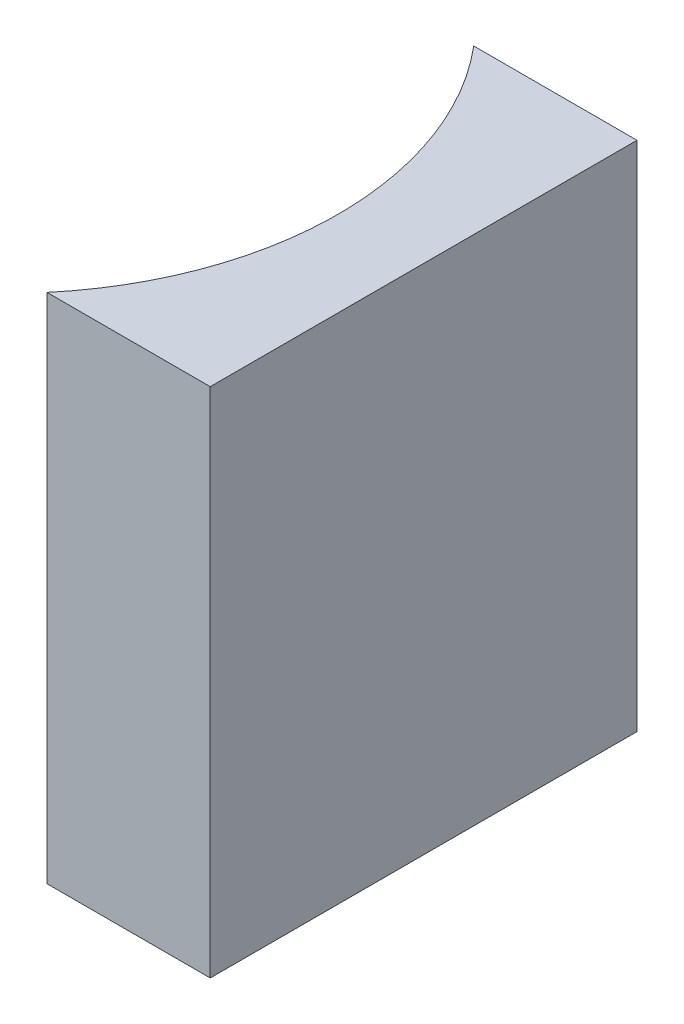
ISO-10303-21;
HEADER;
FILE_DESCRIPTION(('STEP AP214'),'2;1');
FILE_NAME('part.step','',(''),(''),'','','');
FILE_SCHEMA(('AUTOMOTIVE_DESIGN { 1 0 10303 214 1 1 1 1 }'));
ENDSEC;
DATA;
#1=APPLICATION_CONTEXT('core data for automotive mechanical design processes');
#2=APPLICATION_PROTOCOL_DEFINITION('international standard','automotive_design',2000,#1);
#3=PRODUCT_CONTEXT('',#1,'mechanical');
#4=PRODUCT('Part','Part','',(#3));
#5=PRODUCT_RELATED_PRODUCT_CATEGORY('part','',(#4));
#6=PRODUCT_DEFINITION_FORMATION('','',#4);
#7=PRODUCT_DEFINITION_CONTEXT('part definition',#1,'design');
#8=PRODUCT_DEFINITION('design','',#6,#7);
#9=PRODUCT_DEFINITION_SHAPE('','',#8);
#10=(LENGTH_UNIT() NAMED_UNIT(*) SI_UNIT(.MILLI.,.METRE.));
#11=(NAMED_UNIT(*) PLANE_ANGLE_UNIT() SI_UNIT($,.RADIAN.));
#12=(NAMED_UNIT(*) SI_UNIT($,.STERADIAN.) SOLID_ANGLE_UNIT());
#13=UNCERTAINTY_MEASURE_WITH_UNIT(LENGTH_MEASURE(1.E-05),#10,'distance_accuracy_value','');
#14=(GEOMETRIC_REPRESENTATION_CONTEXT(3) GLOBAL_UNCERTAINTY_ASSIGNED_CONTEXT((#13)) GLOBAL_UNIT_ASSIGNED_CONTEXT((#10,
#11,#12)) REPRESENTATION_CONTEXT('',''));
#15=CARTESIAN_POINT('',(0.,0.,0.));
#16=DIRECTION('',(0.,0.,1.));
#17=DIRECTION('',(1.,0.,0.));
#18=AXIS2_PLACEMENT_3D('',#15,#16,#17);
#19=CARTESIAN_POINT('',(0.,12.,0.));
#20=DIRECTION('',(0.,0.,1.));
#21=DIRECTION('',(1.,0.,0.));
#22=AXIS2_PLACEMENT_3D('',#19,#20,#21);
#23=PLANE('',#22);
#24=DIRECTION('',(-1.,0.,0.));
#25=VECTOR('',#24,1.);
#26=CARTESIAN_POINT('',(0.,0.,0.));
#27=LINE('',#26,#25);
#28=CARTESIAN_POINT('',(0.,0.,0.));
#29=VERTEX_POINT('',#28);
#30=CARTESIAN_POINT('',(-3.82555815598467,0.,0.));
#31=VERTEX_POINT('',#30);
#32=EDGE_CURVE('E98',#29,#31,#27,.T.);
#33=ORIENTED_EDGE('',*,*,#32,.T.);
#34=DIRECTION('',(0.,-1.,0.));
#35=VECTOR('',#34,1.);
#36=CARTESIAN_POINT('',(-3.82555815598467,12.,0.));
#37=LINE('',#36,#35);
#38=CARTESIAN_POINT('',(-3.82555815598467,12.,0.));
#39=VERTEX_POINT('',#38);
#40=EDGE_CURVE('E11',#39,#31,#37,.T.);
#41=ORIENTED_EDGE('',*,*,#40,.F.);
#42=DIRECTION('',(-1.,0.,0.));
#43=VECTOR('',#42,1.);
#44=CARTESIAN_POINT('',(0.,12.,0.));
#45=LINE('',#44,#43);
#46=CARTESIAN_POINT('',(0.,12.,0.));
#47=VERTEX_POINT('',#46);
#48=EDGE_CURVE('E86',#47,#39,#45,.T.);
#49=ORIENTED_EDGE('',*,*,#48,.F.);
#50=DIRECTION('',(0.,-1.,0.));
#51=VECTOR('',#50,1.);
#52=CARTESIAN_POINT('',(0.,12.,0.));
#53=LINE('',#52,#51);
#54=EDGE_CURVE('E94',#47,#29,#53,.T.);
#55=ORIENTED_EDGE('',*,*,#54,.T.);
#56=EDGE_LOOP('',(#33,#41,#49,#55));
#57=FACE_BOUND('',#56,.T.);
#58=ADVANCED_FACE('F35',(#57),#23,.F.);
#59=CARTESIAN_POINT('',(-9.76,12.,5.));
#60=DIRECTION('',(0.,-1.,0.));
#61=DIRECTION('',(0.,0.,-1.));
#62=AXIS2_PLACEMENT_3D('',#59,#60,#61);
#63=CYLINDRICAL_SURFACE('',#62,7.76);
#64=CARTESIAN_POINT('',(-9.76,0.,5.));
#65=DIRECTION('',(0.,-1.,0.));
#66=DIRECTION('',(0.,0.,1.));
#67=AXIS2_PLACEMENT_3D('',#64,#65,#66);
#68=CIRCLE('',#67,7.76);
#69=CARTESIAN_POINT('',(-3.82555815598467,0.,10.));
#70=VERTEX_POINT('',#69);
#71=EDGE_CURVE('E90',#31,#70,#68,.T.);
#72=ORIENTED_EDGE('',*,*,#71,.T.);
#73=DIRECTION('',(0.,-1.,0.));
#74=VECTOR('',#73,1.);
#75=CARTESIAN_POINT('',(-3.82555815598467,12.,10.));
#76=LINE('',#75,#74);
#77=CARTESIAN_POINT('',(-3.82555815598467,12.,10.));
#78=VERTEX_POINT('',#77);
#79=EDGE_CURVE('E43',#78,#70,#76,.T.);
#80=ORIENTED_EDGE('',*,*,#79,.F.);
#81=CARTESIAN_POINT('',(-9.76,12.,5.));
#82=DIRECTION('',(0.,-1.,0.));
#83=DIRECTION('',(0.,0.,1.));
#84=AXIS2_PLACEMENT_3D('',#81,#82,#83);
#85=CIRCLE('',#84,7.76);
#86=EDGE_CURVE('E81',#39,#78,#85,.T.);
#87=ORIENTED_EDGE('',*,*,#86,.F.);
#88=ORIENTED_EDGE('',*,*,#40,.T.);
#89=EDGE_LOOP('',(#72,#80,#87,#88));
#90=FACE_BOUND('',#89,.T.);
#91=ADVANCED_FACE('F89',(#90),#63,.F.);
#92=CARTESIAN_POINT('',(0.,12.,10.));
#93=DIRECTION('',(0.,0.,-1.));
#94=DIRECTION('',(-1.,0.,0.));
#95=AXIS2_PLACEMENT_3D('',#92,#93,#94);
#96=PLANE('',#95);
#97=DIRECTION('',(1.,0.,0.));
#98=VECTOR('',#97,1.);
#99=CARTESIAN_POINT('',(0.,0.,10.));
#100=LINE('',#99,#98);
#101=CARTESIAN_POINT('',(0.,0.,10.));
#102=VERTEX_POINT('',#101);
#103=EDGE_CURVE('E68',#70,#102,#100,.T.);
#104=ORIENTED_EDGE('',*,*,#103,.T.);
#105=DIRECTION('',(0.,-1.,0.));
#106=VECTOR('',#105,1.);
#107=CARTESIAN_POINT('',(0.,12.,10.));
#108=LINE('',#107,#106);
#109=CARTESIAN_POINT('',(0.,12.,10.));
#110=VERTEX_POINT('',#109);
#111=EDGE_CURVE('E91',#110,#102,#108,.T.);
#112=ORIENTED_EDGE('',*,*,#111,.F.);
#113=DIRECTION('',(1.,0.,0.));
#114=VECTOR('',#113,1.);
#115=CARTESIAN_POINT('',(0.,12.,10.));
#116=LINE('',#115,#114);
#117=EDGE_CURVE('E84',#78,#110,#116,.T.);
#118=ORIENTED_EDGE('',*,*,#117,.F.);
#119=ORIENTED_EDGE('',*,*,#79,.T.);
#120=EDGE_LOOP('',(#104,#112,#118,#119));
#121=FACE_BOUND('',#120,.T.);
#122=ADVANCED_FACE('F92',(#121),#96,.F.);
#123=CARTESIAN_POINT('',(0.,12.,0.));
#124=DIRECTION('',(-1.,0.,0.));
#125=DIRECTION('',(0.,0.,1.));
#126=AXIS2_PLACEMENT_3D('',#123,#124,#125);
#127=PLANE('',#126);
#128=DIRECTION('',(0.,0.,-1.));
#129=VECTOR('',#128,1.);
#130=CARTESIAN_POINT('',(0.,0.,0.));
#131=LINE('',#130,#129);
#132=EDGE_CURVE('E74',#102,#29,#131,.T.);
#133=ORIENTED_EDGE('',*,*,#132,.T.);
#134=ORIENTED_EDGE('',*,*,#54,.F.);
#135=DIRECTION('',(0.,0.,-1.));
#136=VECTOR('',#135,1.);
#137=CARTESIAN_POINT('',(0.,12.,0.));
#138=LINE('',#137,#136);
#139=EDGE_CURVE('E51',#110,#47,#138,.T.);
#140=ORIENTED_EDGE('',*,*,#139,.F.);
#141=ORIENTED_EDGE('',*,*,#111,.T.);
#142=EDGE_LOOP('',(#133,#134,#140,#141));
#143=FACE_BOUND('',#142,.T.);
#144=ADVANCED_FACE('F105',(#143),#127,.F.);
#145=CARTESIAN_POINT('',(-9.76,12.,5.));
#146=DIRECTION('',(0.,1.,0.));
#147=DIRECTION('',(0.,0.,1.));
#148=AXIS2_PLACEMENT_3D('',#145,#146,#147);
#149=PLANE('',#148);
#150=ORIENTED_EDGE('',*,*,#48,.T.);
#151=ORIENTED_EDGE('',*,*,#86,.T.);
#152=ORIENTED_EDGE('',*,*,#117,.T.);
#153=ORIENTED_EDGE('',*,*,#139,.T.);
#154=EDGE_LOOP('',(#150,#151,#152,#153));
#155=FACE_BOUND('',#154,.T.);
#156=ADVANCED_FACE('F82',(#155),#149,.T.);
#157=CARTESIAN_POINT('',(-9.76,0.,5.));
#158=DIRECTION('',(0.,1.,0.));
#159=DIRECTION('',(0.,0.,1.));
#160=AXIS2_PLACEMENT_3D('',#157,#158,#159);
#161=PLANE('',#160);
#162=ORIENTED_EDGE('',*,*,#32,.F.);
#163=ORIENTED_EDGE('',*,*,#132,.F.);
#164=ORIENTED_EDGE('',*,*,#103,.F.);
#165=ORIENTED_EDGE('',*,*,#71,.F.);
#166=EDGE_LOOP('',(#162,#163,#164,#165));
#167=FACE_BOUND('',#166,.T.);
#168=ADVANCED_FACE('F108',(#167),#161,.F.);
#169=CLOSED_SHELL('',(#58,#91,#122,#144,#156,#168));
#170=MANIFOLD_SOLID_BREP('B2',#169);
#171=ADVANCED_BREP_SHAPE_REPRESENTATION('',(#18,#170),#14);
#172=SHAPE_DEFINITION_REPRESENTATION(#9,#171);
ENDSEC;
END-ISO-10303-21;
